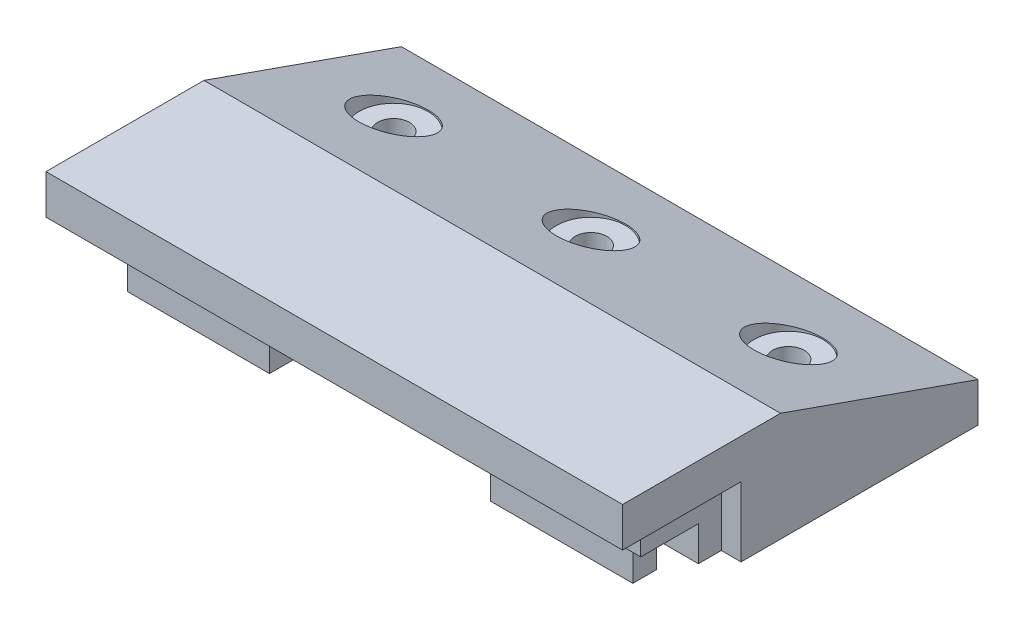
ISO-10303-21;
HEADER;
FILE_DESCRIPTION(('STEP AP214'),'2;1');
FILE_NAME('part.step','',(''),(''),'','','');
FILE_SCHEMA(('AUTOMOTIVE_DESIGN { 1 0 10303 214 1 1 1 1 }'));
ENDSEC;
DATA;
#1=APPLICATION_CONTEXT('core data for automotive mechanical design processes');
#2=APPLICATION_PROTOCOL_DEFINITION('international standard','automotive_design',2000,#1);
#3=PRODUCT_CONTEXT('',#1,'mechanical');
#4=PRODUCT('Part','Part','',(#3));
#5=PRODUCT_RELATED_PRODUCT_CATEGORY('part','',(#4));
#6=PRODUCT_DEFINITION_FORMATION('','',#4);
#7=PRODUCT_DEFINITION_CONTEXT('part definition',#1,'design');
#8=PRODUCT_DEFINITION('design','',#6,#7);
#9=PRODUCT_DEFINITION_SHAPE('','',#8);
#10=(LENGTH_UNIT() NAMED_UNIT(*) SI_UNIT(.MILLI.,.METRE.));
#11=(NAMED_UNIT(*) PLANE_ANGLE_UNIT() SI_UNIT($,.RADIAN.));
#12=(NAMED_UNIT(*) SI_UNIT($,.STERADIAN.) SOLID_ANGLE_UNIT());
#13=UNCERTAINTY_MEASURE_WITH_UNIT(LENGTH_MEASURE(1.E-05),#10,'distance_accuracy_value','');
#14=(GEOMETRIC_REPRESENTATION_CONTEXT(3) GLOBAL_UNCERTAINTY_ASSIGNED_CONTEXT((#13)) GLOBAL_UNIT_ASSIGNED_CONTEXT((#10,
#11,#12)) REPRESENTATION_CONTEXT('',''));
#15=CARTESIAN_POINT('',(0.,0.,0.));
#16=DIRECTION('',(0.,0.,1.));
#17=DIRECTION('',(1.,0.,0.));
#18=AXIS2_PLACEMENT_3D('',#15,#16,#17);
#19=CARTESIAN_POINT('',(46.355,-5.588,-19.05));
#20=DIRECTION('',(0.,1.,0.));
#21=DIRECTION('',(0.,0.,1.));
#22=AXIS2_PLACEMENT_3D('',#19,#20,#21);
#23=PLANE('',#22);
#24=DIRECTION('',(0.,0.,1.));
#25=VECTOR('',#24,1.);
#26=CARTESIAN_POINT('',(-17.78,-5.588,-11.176));
#27=LINE('',#26,#25);
#28=CARTESIAN_POINT('',(-17.78,-5.588,-11.176));
#29=VERTEX_POINT('',#28);
#30=CARTESIAN_POINT('',(-17.78,-5.588,-7.36600000000001));
#31=VERTEX_POINT('',#30);
#32=EDGE_CURVE('E249',#29,#31,#27,.T.);
#33=ORIENTED_EDGE('',*,*,#32,.F.);
#34=DIRECTION('',(1.,0.,0.));
#35=VECTOR('',#34,1.);
#36=CARTESIAN_POINT('',(-40.64,-5.588,-11.176));
#37=LINE('',#36,#35);
#38=CARTESIAN_POINT('',(-40.64,-5.588,-11.176));
#39=VERTEX_POINT('',#38);
#40=EDGE_CURVE('E245',#39,#29,#37,.T.);
#41=ORIENTED_EDGE('',*,*,#40,.F.);
#42=DIRECTION('',(0.,0.,-1.));
#43=VECTOR('',#42,1.);
#44=CARTESIAN_POINT('',(-40.64,-5.588,-7.36600000000001));
#45=LINE('',#44,#43);
#46=CARTESIAN_POINT('',(-40.64,-5.588,-7.36600000000001));
#47=VERTEX_POINT('',#46);
#48=EDGE_CURVE('E240',#47,#39,#45,.T.);
#49=ORIENTED_EDGE('',*,*,#48,.F.);
#50=DIRECTION('',(-1.,0.,0.));
#51=VECTOR('',#50,1.);
#52=CARTESIAN_POINT('',(-17.78,-5.588,-7.36600000000001));
#53=LINE('',#52,#51);
#54=EDGE_CURVE('E236',#31,#47,#53,.T.);
#55=ORIENTED_EDGE('',*,*,#54,.F.);
#56=EDGE_LOOP('',(#33,#41,#49,#55));
#57=FACE_BOUND('',#56,.T.);
#58=DIRECTION('',(0.,0.,1.));
#59=VECTOR('',#58,1.);
#60=CARTESIAN_POINT('',(43.18,-5.588,0.));
#61=LINE('',#60,#59);
#62=CARTESIAN_POINT('',(43.18,-5.588,-15.367));
#63=VERTEX_POINT('',#62);
#64=CARTESIAN_POINT('',(43.18,-5.588,-6.09600000000001));
#65=VERTEX_POINT('',#64);
#66=EDGE_CURVE('E279',#63,#65,#61,.T.);
#67=ORIENTED_EDGE('',*,*,#66,.T.);
#68=DIRECTION('',(-1.,0.,0.));
#69=VECTOR('',#68,1.);
#70=CARTESIAN_POINT('',(0.,-5.588,-6.09600000000001));
#71=LINE('',#70,#69);
#72=CARTESIAN_POINT('',(-43.18,-5.588,-6.09600000000001));
#73=VERTEX_POINT('',#72);
#74=EDGE_CURVE('E275',#65,#73,#71,.T.);
#75=ORIENTED_EDGE('',*,*,#74,.T.);
#76=DIRECTION('',(0.,0.,-1.));
#77=VECTOR('',#76,1.);
#78=CARTESIAN_POINT('',(-43.18,-5.588,0.));
#79=LINE('',#78,#77);
#80=CARTESIAN_POINT('',(-43.18,-5.588,-15.367));
#81=VERTEX_POINT('',#80);
#82=EDGE_CURVE('E272',#73,#81,#79,.T.);
#83=ORIENTED_EDGE('',*,*,#82,.T.);
#84=DIRECTION('',(-1.,0.,0.));
#85=VECTOR('',#84,1.);
#86=CARTESIAN_POINT('',(0.,-5.588,-15.367));
#87=LINE('',#86,#85);
#88=EDGE_CURVE('E276',#63,#81,#87,.T.);
#89=ORIENTED_EDGE('',*,*,#88,.F.);
#90=EDGE_LOOP('',(#67,#75,#83,#89));
#91=FACE_BOUND('',#90,.T.);
#92=DIRECTION('',(0.,0.,-1.));
#93=VECTOR('',#92,1.);
#94=CARTESIAN_POINT('',(17.78,-5.588,-11.176));
#95=LINE('',#94,#93);
#96=CARTESIAN_POINT('',(17.78,-5.588,-7.36600000000001));
#97=VERTEX_POINT('',#96);
#98=CARTESIAN_POINT('',(17.78,-5.588,-11.176));
#99=VERTEX_POINT('',#98);
#100=EDGE_CURVE('E65',#97,#99,#95,.T.);
#101=ORIENTED_EDGE('',*,*,#100,.F.);
#102=DIRECTION('',(-1.,0.,0.));
#103=VECTOR('',#102,1.);
#104=CARTESIAN_POINT('',(17.78,-5.588,-7.36600000000001));
#105=LINE('',#104,#103);
#106=CARTESIAN_POINT('',(40.64,-5.588,-7.36600000000001));
#107=VERTEX_POINT('',#106);
#108=EDGE_CURVE('E70',#107,#97,#105,.T.);
#109=ORIENTED_EDGE('',*,*,#108,.F.);
#110=DIRECTION('',(0.,0.,1.));
#111=VECTOR('',#110,1.);
#112=CARTESIAN_POINT('',(40.64,-5.588,-7.36600000000001));
#113=LINE('',#112,#111);
#114=CARTESIAN_POINT('',(40.64,-5.588,-11.176));
#115=VERTEX_POINT('',#114);
#116=EDGE_CURVE('E207',#115,#107,#113,.T.);
#117=ORIENTED_EDGE('',*,*,#116,.F.);
#118=DIRECTION('',(1.,0.,0.));
#119=VECTOR('',#118,1.);
#120=CARTESIAN_POINT('',(40.64,-5.588,-11.176));
#121=LINE('',#120,#119);
#122=EDGE_CURVE('E241',#99,#115,#121,.T.);
#123=ORIENTED_EDGE('',*,*,#122,.F.);
#124=EDGE_LOOP('',(#101,#109,#117,#123));
#125=FACE_BOUND('',#124,.T.);
#126=ADVANCED_FACE('F47',(#57,#91,#125),#23,.F.);
#127=CARTESIAN_POINT('',(0.,-97.6144988821532,-15.367));
#128=DIRECTION('',(0.,0.,1.));
#129=DIRECTION('',(1.,0.,0.));
#130=AXIS2_PLACEMENT_3D('',#127,#128,#129);
#131=PLANE('',#130);
#132=DIRECTION('',(0.,1.,0.));
#133=VECTOR('',#132,1.);
#134=CARTESIAN_POINT('',(43.18,-97.6144988821532,-15.367));
#135=LINE('',#134,#133);
#136=CARTESIAN_POINT('',(43.18,-11.176,-15.367));
#137=VERTEX_POINT('',#136);
#138=EDGE_CURVE('E318',#137,#63,#135,.T.);
#139=ORIENTED_EDGE('',*,*,#138,.T.);
#140=ORIENTED_EDGE('',*,*,#88,.T.);
#141=DIRECTION('',(0.,1.,0.));
#142=VECTOR('',#141,1.);
#143=CARTESIAN_POINT('',(-43.18,-97.6144988821532,-15.367));
#144=LINE('',#143,#142);
#145=CARTESIAN_POINT('',(-43.18,-11.176,-15.367));
#146=VERTEX_POINT('',#145);
#147=EDGE_CURVE('E314',#146,#81,#144,.T.);
#148=ORIENTED_EDGE('',*,*,#147,.F.);
#149=DIRECTION('',(-1.,0.,0.));
#150=VECTOR('',#149,1.);
#151=CARTESIAN_POINT('',(0.,-11.176,-15.367));
#152=LINE('',#151,#150);
#153=EDGE_CURVE('E297',#137,#146,#152,.T.);
#154=ORIENTED_EDGE('',*,*,#153,.F.);
#155=EDGE_LOOP('',(#139,#140,#148,#154));
#156=FACE_BOUND('',#155,.T.);
#157=ADVANCED_FACE('F466',(#156),#131,.T.);
#158=CARTESIAN_POINT('',(46.355,0.,0.));
#159=DIRECTION('',(0.,1.,0.));
#160=DIRECTION('',(0.,0.,1.));
#161=AXIS2_PLACEMENT_3D('',#158,#159,#160);
#162=PLANE('',#161);
#163=DIRECTION('',(0.,0.,1.));
#164=VECTOR('',#163,1.);
#165=CARTESIAN_POINT('',(-43.18,0.,0.));
#166=LINE('',#165,#164);
#167=CARTESIAN_POINT('',(-43.18,0.,-19.05));
#168=VERTEX_POINT('',#167);
#169=CARTESIAN_POINT('',(-43.18,0.,-6.09600000000001));
#170=VERTEX_POINT('',#169);
#171=EDGE_CURVE('E307',#168,#170,#166,.T.);
#172=ORIENTED_EDGE('',*,*,#171,.T.);
#173=DIRECTION('',(1.,0.,0.));
#174=VECTOR('',#173,1.);
#175=CARTESIAN_POINT('',(0.,0.,-6.09600000000001));
#176=LINE('',#175,#174);
#177=CARTESIAN_POINT('',(43.18,0.,-6.09600000000001));
#178=VERTEX_POINT('',#177);
#179=EDGE_CURVE('E235',#170,#178,#176,.T.);
#180=ORIENTED_EDGE('',*,*,#179,.T.);
#181=DIRECTION('',(0.,0.,1.));
#182=VECTOR('',#181,1.);
#183=CARTESIAN_POINT('',(43.18,0.,0.));
#184=LINE('',#183,#182);
#185=CARTESIAN_POINT('',(43.18,0.,-19.05));
#186=VERTEX_POINT('',#185);
#187=EDGE_CURVE('E282',#186,#178,#184,.T.);
#188=ORIENTED_EDGE('',*,*,#187,.F.);
#189=DIRECTION('',(-1.,0.,0.));
#190=VECTOR('',#189,1.);
#191=CARTESIAN_POINT('',(46.355,0.,-19.05));
#192=LINE('',#191,#190);
#193=CARTESIAN_POINT('',(46.355,0.,-19.05));
#194=VERTEX_POINT('',#193);
#195=EDGE_CURVE('E57',#194,#186,#192,.T.);
#196=ORIENTED_EDGE('',*,*,#195,.F.);
#197=DIRECTION('',(0.,0.,-1.));
#198=VECTOR('',#197,1.);
#199=CARTESIAN_POINT('',(46.355,0.,0.));
#200=LINE('',#199,#198);
#201=CARTESIAN_POINT('',(46.355,0.,0.));
#202=VERTEX_POINT('',#201);
#203=EDGE_CURVE('E332',#202,#194,#200,.T.);
#204=ORIENTED_EDGE('',*,*,#203,.F.);
#205=DIRECTION('',(-1.,0.,0.));
#206=VECTOR('',#205,1.);
#207=CARTESIAN_POINT('',(46.355,0.,0.));
#208=LINE('',#207,#206);
#209=CARTESIAN_POINT('',(-46.355,0.,0.));
#210=VERTEX_POINT('',#209);
#211=EDGE_CURVE('E12',#202,#210,#208,.T.);
#212=ORIENTED_EDGE('',*,*,#211,.T.);
#213=DIRECTION('',(0.,0.,-1.));
#214=VECTOR('',#213,1.);
#215=CARTESIAN_POINT('',(-46.355,0.,0.));
#216=LINE('',#215,#214);
#217=CARTESIAN_POINT('',(-46.355,0.,-19.05));
#218=VERTEX_POINT('',#217);
#219=EDGE_CURVE('E355',#210,#218,#216,.T.);
#220=ORIENTED_EDGE('',*,*,#219,.T.);
#221=EDGE_CURVE('E394',#168,#218,#192,.T.);
#222=ORIENTED_EDGE('',*,*,#221,.F.);
#223=EDGE_LOOP('',(#172,#180,#188,#196,#204,#212,#220,#222));
#224=FACE_BOUND('',#223,.T.);
#225=ADVANCED_FACE('F474',(#224),#162,.F.);
#226=CARTESIAN_POINT('',(46.355,0.,-19.05));
#227=DIRECTION('',(0.,0.,-1.));
#228=DIRECTION('',(-1.,0.,0.));
#229=AXIS2_PLACEMENT_3D('',#226,#227,#228);
#230=PLANE('',#229);
#231=DIRECTION('',(0.,1.,0.));
#232=VECTOR('',#231,1.);
#233=CARTESIAN_POINT('',(43.18,-97.6144988821532,-19.05));
#234=LINE('',#233,#232);
#235=CARTESIAN_POINT('',(43.18,-11.176,-19.05));
#236=VERTEX_POINT('',#235);
#237=EDGE_CURVE('E301',#236,#186,#234,.T.);
#238=ORIENTED_EDGE('',*,*,#237,.F.);
#239=DIRECTION('',(-1.,0.,0.));
#240=VECTOR('',#239,1.);
#241=CARTESIAN_POINT('',(46.355,-11.176,-19.05));
#242=LINE('',#241,#240);
#243=CARTESIAN_POINT('',(46.355,-11.176,-19.05));
#244=VERTEX_POINT('',#243);
#245=EDGE_CURVE('E390',#244,#236,#242,.T.);
#246=ORIENTED_EDGE('',*,*,#245,.F.);
#247=DIRECTION('',(0.,-1.,0.));
#248=VECTOR('',#247,1.);
#249=CARTESIAN_POINT('',(46.355,0.,-19.05));
#250=LINE('',#249,#248);
#251=EDGE_CURVE('E336',#194,#244,#250,.T.);
#252=ORIENTED_EDGE('',*,*,#251,.F.);
#253=ORIENTED_EDGE('',*,*,#195,.T.);
#254=EDGE_LOOP('',(#238,#246,#252,#253));
#255=FACE_BOUND('',#254,.T.);
#256=ADVANCED_FACE('F520',(#255),#230,.F.);
#257=CARTESIAN_POINT('',(46.355,0.,0.));
#258=DIRECTION('',(0.,0.,-1.));
#259=DIRECTION('',(-1.,0.,0.));
#260=AXIS2_PLACEMENT_3D('',#257,#258,#259);
#261=PLANE('',#260);
#262=DIRECTION('',(0.,-1.,0.));
#263=VECTOR('',#262,1.);
#264=CARTESIAN_POINT('',(-46.355,0.,0.));
#265=LINE('',#264,#263);
#266=CARTESIAN_POINT('',(-46.355,6.35,0.));
#267=VERTEX_POINT('',#266);
#268=EDGE_CURVE('E327',#267,#210,#265,.T.);
#269=ORIENTED_EDGE('',*,*,#268,.T.);
#270=ORIENTED_EDGE('',*,*,#211,.F.);
#271=DIRECTION('',(0.,-1.,0.));
#272=VECTOR('',#271,1.);
#273=CARTESIAN_POINT('',(46.355,0.,0.));
#274=LINE('',#273,#272);
#275=CARTESIAN_POINT('',(46.355,6.35,0.));
#276=VERTEX_POINT('',#275);
#277=EDGE_CURVE('E328',#276,#202,#274,.T.);
#278=ORIENTED_EDGE('',*,*,#277,.F.);
#279=DIRECTION('',(-1.,0.,0.));
#280=VECTOR('',#279,1.);
#281=CARTESIAN_POINT('',(46.355,6.35,0.));
#282=LINE('',#281,#280);
#283=EDGE_CURVE('E351',#276,#267,#282,.T.);
#284=ORIENTED_EDGE('',*,*,#283,.T.);
#285=EDGE_LOOP('',(#269,#270,#278,#284));
#286=FACE_BOUND('',#285,.T.);
#287=ADVANCED_FACE('F49',(#286),#261,.F.);
#288=CARTESIAN_POINT('',(-43.18,-11.176,-19.05));
#289=VERTEX_POINT('',#288);
#290=CARTESIAN_POINT('',(-46.355,-11.176,-19.05));
#291=VERTEX_POINT('',#290);
#292=EDGE_CURVE('E389',#289,#291,#242,.T.);
#293=ORIENTED_EDGE('',*,*,#292,.F.);
#294=DIRECTION('',(0.,1.,0.));
#295=VECTOR('',#294,1.);
#296=CARTESIAN_POINT('',(-43.18,-97.6144988821532,-19.05));
#297=LINE('',#296,#295);
#298=EDGE_CURVE('E310',#289,#168,#297,.T.);
#299=ORIENTED_EDGE('',*,*,#298,.T.);
#300=ORIENTED_EDGE('',*,*,#221,.T.);
#301=DIRECTION('',(0.,-1.,0.));
#302=VECTOR('',#301,1.);
#303=CARTESIAN_POINT('',(-46.355,0.,-19.05));
#304=LINE('',#303,#302);
#305=EDGE_CURVE('E359',#218,#291,#304,.T.);
#306=ORIENTED_EDGE('',*,*,#305,.T.);
#307=EDGE_LOOP('',(#293,#299,#300,#306));
#308=FACE_BOUND('',#307,.T.);
#309=ADVANCED_FACE('F516',(#308),#230,.F.);
#310=CARTESIAN_POINT('',(46.355,-11.176,-19.05));
#311=DIRECTION('',(0.,1.,0.));
#312=DIRECTION('',(0.,0.,1.));
#313=AXIS2_PLACEMENT_3D('',#310,#311,#312);
#314=PLANE('',#313);
#315=CARTESIAN_POINT('',(31.75,-11.176,-41.275));
#316=DIRECTION('',(0.,1.,0.));
#317=DIRECTION('',(0.,0.,1.));
#318=AXIS2_PLACEMENT_3D('',#315,#316,#317);
#319=CIRCLE('',#318,2.5527);
#320=CARTESIAN_POINT('',(31.75,-11.176,-38.7223));
#321=VERTEX_POINT('',#320);
#322=EDGE_CURVE('E830',#321,#321,#319,.T.);
#323=ORIENTED_EDGE('',*,*,#322,.T.);
#324=EDGE_LOOP('',(#323));
#325=FACE_BOUND('',#324,.T.);
#326=CARTESIAN_POINT('',(-31.75,-11.176,-41.275));
#327=DIRECTION('',(0.,1.,0.));
#328=DIRECTION('',(0.,0.,1.));
#329=AXIS2_PLACEMENT_3D('',#326,#327,#328);
#330=CIRCLE('',#329,2.55269999999999);
#331=CARTESIAN_POINT('',(-31.75,-11.176,-38.7223));
#332=VERTEX_POINT('',#331);
#333=EDGE_CURVE('E406',#332,#332,#330,.T.);
#334=ORIENTED_EDGE('',*,*,#333,.T.);
#335=EDGE_LOOP('',(#334));
#336=FACE_BOUND('',#335,.T.);
#337=CARTESIAN_POINT('',(0.,-11.176,-41.275));
#338=DIRECTION('',(0.,1.,0.));
#339=DIRECTION('',(0.,0.,1.));
#340=AXIS2_PLACEMENT_3D('',#337,#338,#339);
#341=CIRCLE('',#340,2.5527);
#342=CARTESIAN_POINT('',(0.,-11.176,-38.7223));
#343=VERTEX_POINT('',#342);
#344=EDGE_CURVE('E401',#343,#343,#341,.T.);
#345=ORIENTED_EDGE('',*,*,#344,.T.);
#346=EDGE_LOOP('',(#345));
#347=FACE_BOUND('',#346,.T.);
#348=DIRECTION('',(0.,0.,-1.));
#349=VECTOR('',#348,1.);
#350=CARTESIAN_POINT('',(-46.355,-11.176,-19.05));
#351=LINE('',#350,#349);
#352=CARTESIAN_POINT('',(-46.355,-11.176,-57.15));
#353=VERTEX_POINT('',#352);
#354=EDGE_CURVE('E363',#291,#353,#351,.T.);
#355=ORIENTED_EDGE('',*,*,#354,.T.);
#356=DIRECTION('',(-1.,0.,0.));
#357=VECTOR('',#356,1.);
#358=CARTESIAN_POINT('',(46.355,-11.176,-57.15));
#359=LINE('',#358,#357);
#360=CARTESIAN_POINT('',(46.355,-11.176,-57.15));
#361=VERTEX_POINT('',#360);
#362=EDGE_CURVE('E385',#361,#353,#359,.T.);
#363=ORIENTED_EDGE('',*,*,#362,.F.);
#364=DIRECTION('',(0.,0.,-1.));
#365=VECTOR('',#364,1.);
#366=CARTESIAN_POINT('',(46.355,-11.176,-19.05));
#367=LINE('',#366,#365);
#368=EDGE_CURVE('E339',#244,#361,#367,.T.);
#369=ORIENTED_EDGE('',*,*,#368,.F.);
#370=ORIENTED_EDGE('',*,*,#245,.T.);
#371=DIRECTION('',(0.,0.,-1.));
#372=VECTOR('',#371,1.);
#373=CARTESIAN_POINT('',(43.18,-11.176,0.));
#374=LINE('',#373,#372);
#375=EDGE_CURVE('E300',#137,#236,#374,.T.);
#376=ORIENTED_EDGE('',*,*,#375,.F.);
#377=ORIENTED_EDGE('',*,*,#153,.T.);
#378=DIRECTION('',(0.,0.,-1.));
#379=VECTOR('',#378,1.);
#380=CARTESIAN_POINT('',(-43.18,-11.176,0.));
#381=LINE('',#380,#379);
#382=EDGE_CURVE('E304',#146,#289,#381,.T.);
#383=ORIENTED_EDGE('',*,*,#382,.T.);
#384=ORIENTED_EDGE('',*,*,#292,.T.);
#385=EDGE_LOOP('',(#355,#363,#369,#370,#376,#377,#383,#384));
#386=FACE_BOUND('',#385,.T.);
#387=ADVANCED_FACE('F512',(#325,#336,#347,#386),#314,.F.);
#388=CARTESIAN_POINT('',(46.355,-11.176,-57.15));
#389=DIRECTION('',(0.,0.,1.));
#390=DIRECTION('',(1.,0.,0.));
#391=AXIS2_PLACEMENT_3D('',#388,#389,#390);
#392=PLANE('',#391);
#393=DIRECTION('',(0.,1.,0.));
#394=VECTOR('',#393,1.);
#395=CARTESIAN_POINT('',(-46.355,-11.176,-57.15));
#396=LINE('',#395,#394);
#397=CARTESIAN_POINT('',(-46.355,-4.826,-57.15));
#398=VERTEX_POINT('',#397);
#399=EDGE_CURVE('E366',#353,#398,#396,.T.);
#400=ORIENTED_EDGE('',*,*,#399,.T.);
#401=DIRECTION('',(-1.,0.,0.));
#402=VECTOR('',#401,1.);
#403=CARTESIAN_POINT('',(46.355,-4.826,-57.15));
#404=LINE('',#403,#402);
#405=CARTESIAN_POINT('',(46.355,-4.826,-57.15));
#406=VERTEX_POINT('',#405);
#407=EDGE_CURVE('E381',#406,#398,#404,.T.);
#408=ORIENTED_EDGE('',*,*,#407,.F.);
#409=DIRECTION('',(0.,1.,0.));
#410=VECTOR('',#409,1.);
#411=CARTESIAN_POINT('',(46.355,-11.176,-57.15));
#412=LINE('',#411,#410);
#413=EDGE_CURVE('E342',#361,#406,#412,.T.);
#414=ORIENTED_EDGE('',*,*,#413,.F.);
#415=ORIENTED_EDGE('',*,*,#362,.T.);
#416=EDGE_LOOP('',(#400,#408,#414,#415));
#417=FACE_BOUND('',#416,.T.);
#418=ADVANCED_FACE('F508',(#417),#392,.F.);
#419=CARTESIAN_POINT('',(46.355,-4.826,-57.15));
#420=DIRECTION('',(0.,-0.943268630175215,0.332030557821676));
#421=DIRECTION('',(0.,-0.332030557821676,-0.943268630175215));
#422=AXIS2_PLACEMENT_3D('',#419,#420,#421);
#423=PLANE('',#422);
#424=CARTESIAN_POINT('',(31.75,0.761999999999995,-41.275));
#425=DIRECTION('',(0.,-0.943268630175215,0.332030557821676));
#426=DIRECTION('',(0.,0.332030557821676,0.943268630175215));
#427=AXIS2_PLACEMENT_3D('',#424,#425,#426);
#428=ELLIPSE('',#427,5.89042169139867,5.55625);
#429=CARTESIAN_POINT('',(31.75,2.7178,-35.71875));
#430=VERTEX_POINT('',#429);
#431=EDGE_CURVE('E51',#430,#430,#428,.T.);
#432=ORIENTED_EDGE('',*,*,#431,.T.);
#433=EDGE_LOOP('',(#432));
#434=FACE_BOUND('',#433,.T.);
#435=CARTESIAN_POINT('',(-31.75,0.761999999999995,-41.275));
#436=DIRECTION('',(0.,-0.943268630175215,0.332030557821676));
#437=DIRECTION('',(0.,0.332030557821676,0.943268630175215));
#438=AXIS2_PLACEMENT_3D('',#435,#436,#437);
#439=ELLIPSE('',#438,5.89042169139867,5.55625);
#440=CARTESIAN_POINT('',(-31.75,2.71779999999999,-35.71875));
#441=VERTEX_POINT('',#440);
#442=EDGE_CURVE('E402',#441,#441,#439,.T.);
#443=ORIENTED_EDGE('',*,*,#442,.T.);
#444=EDGE_LOOP('',(#443));
#445=FACE_BOUND('',#444,.T.);
#446=CARTESIAN_POINT('',(0.,0.761999999999995,-41.275));
#447=DIRECTION('',(0.,-0.943268630175215,0.332030557821676));
#448=DIRECTION('',(0.,0.332030557821676,0.943268630175215));
#449=AXIS2_PLACEMENT_3D('',#446,#447,#448);
#450=ELLIPSE('',#449,5.89042169139867,5.55625);
#451=CARTESIAN_POINT('',(0.,2.71779999999999,-35.71875));
#452=VERTEX_POINT('',#451);
#453=EDGE_CURVE('E398',#452,#452,#450,.T.);
#454=ORIENTED_EDGE('',*,*,#453,.T.);
#455=EDGE_LOOP('',(#454));
#456=FACE_BOUND('',#455,.T.);
#457=DIRECTION('',(0.,0.332030557821676,0.943268630175215));
#458=VECTOR('',#457,1.);
#459=CARTESIAN_POINT('',(-46.355,-4.826,-57.15));
#460=LINE('',#459,#458);
#461=CARTESIAN_POINT('',(-46.355,6.35,-25.4));
#462=VERTEX_POINT('',#461);
#463=EDGE_CURVE('E369',#398,#462,#460,.T.);
#464=ORIENTED_EDGE('',*,*,#463,.T.);
#465=DIRECTION('',(-1.,0.,0.));
#466=VECTOR('',#465,1.);
#467=CARTESIAN_POINT('',(46.355,6.35,-25.4));
#468=LINE('',#467,#466);
#469=CARTESIAN_POINT('',(46.355,6.35,-25.4));
#470=VERTEX_POINT('',#469);
#471=EDGE_CURVE('E377',#470,#462,#468,.T.);
#472=ORIENTED_EDGE('',*,*,#471,.F.);
#473=DIRECTION('',(0.,0.332030557821676,0.943268630175215));
#474=VECTOR('',#473,1.);
#475=CARTESIAN_POINT('',(46.355,-4.826,-57.15));
#476=LINE('',#475,#474);
#477=EDGE_CURVE('E345',#406,#470,#476,.T.);
#478=ORIENTED_EDGE('',*,*,#477,.F.);
#479=ORIENTED_EDGE('',*,*,#407,.T.);
#480=EDGE_LOOP('',(#464,#472,#478,#479));
#481=FACE_BOUND('',#480,.T.);
#482=ADVANCED_FACE('F504',(#434,#445,#456,#481),#423,.F.);
#483=CARTESIAN_POINT('',(46.355,6.35,0.));
#484=DIRECTION('',(0.,-1.,0.));
#485=DIRECTION('',(0.,0.,-1.));
#486=AXIS2_PLACEMENT_3D('',#483,#484,#485);
#487=PLANE('',#486);
#488=DIRECTION('',(0.,0.,1.));
#489=VECTOR('',#488,1.);
#490=CARTESIAN_POINT('',(-46.355,6.35,0.));
#491=LINE('',#490,#489);
#492=EDGE_CURVE('E333',#462,#267,#491,.T.);
#493=ORIENTED_EDGE('',*,*,#492,.T.);
#494=ORIENTED_EDGE('',*,*,#283,.F.);
#495=DIRECTION('',(0.,0.,1.));
#496=VECTOR('',#495,1.);
#497=CARTESIAN_POINT('',(46.355,6.35,0.));
#498=LINE('',#497,#496);
#499=EDGE_CURVE('E348',#470,#276,#498,.T.);
#500=ORIENTED_EDGE('',*,*,#499,.F.);
#501=ORIENTED_EDGE('',*,*,#471,.T.);
#502=EDGE_LOOP('',(#493,#494,#500,#501));
#503=FACE_BOUND('',#502,.T.);
#504=ADVANCED_FACE('F497',(#503),#487,.F.);
#505=CARTESIAN_POINT('',(46.355,0.,0.));
#506=DIRECTION('',(-1.,0.,0.));
#507=DIRECTION('',(0.,0.,1.));
#508=AXIS2_PLACEMENT_3D('',#505,#506,#507);
#509=PLANE('',#508);
#510=ORIENTED_EDGE('',*,*,#277,.T.);
#511=ORIENTED_EDGE('',*,*,#203,.T.);
#512=ORIENTED_EDGE('',*,*,#251,.T.);
#513=ORIENTED_EDGE('',*,*,#368,.T.);
#514=ORIENTED_EDGE('',*,*,#413,.T.);
#515=ORIENTED_EDGE('',*,*,#477,.T.);
#516=ORIENTED_EDGE('',*,*,#499,.T.);
#517=EDGE_LOOP('',(#510,#511,#512,#513,#514,#515,#516));
#518=FACE_BOUND('',#517,.T.);
#519=ADVANCED_FACE('F494',(#518),#509,.F.);
#520=CARTESIAN_POINT('',(-46.355,0.,0.));
#521=DIRECTION('',(-1.,0.,0.));
#522=DIRECTION('',(0.,0.,1.));
#523=AXIS2_PLACEMENT_3D('',#520,#521,#522);
#524=PLANE('',#523);
#525=ORIENTED_EDGE('',*,*,#268,.F.);
#526=ORIENTED_EDGE('',*,*,#492,.F.);
#527=ORIENTED_EDGE('',*,*,#463,.F.);
#528=ORIENTED_EDGE('',*,*,#399,.F.);
#529=ORIENTED_EDGE('',*,*,#354,.F.);
#530=ORIENTED_EDGE('',*,*,#305,.F.);
#531=ORIENTED_EDGE('',*,*,#219,.F.);
#532=EDGE_LOOP('',(#525,#526,#527,#528,#529,#530,#531));
#533=FACE_BOUND('',#532,.T.);
#534=ADVANCED_FACE('F492',(#533),#524,.T.);
#535=CARTESIAN_POINT('',(43.18,-97.6144988821532,0.));
#536=DIRECTION('',(-1.,0.,0.));
#537=DIRECTION('',(0.,0.,1.));
#538=AXIS2_PLACEMENT_3D('',#535,#536,#537);
#539=PLANE('',#538);
#540=ORIENTED_EDGE('',*,*,#138,.F.);
#541=ORIENTED_EDGE('',*,*,#375,.T.);
#542=ORIENTED_EDGE('',*,*,#237,.T.);
#543=ORIENTED_EDGE('',*,*,#187,.T.);
#544=DIRECTION('',(0.,1.,0.));
#545=VECTOR('',#544,1.);
#546=CARTESIAN_POINT('',(43.18,-98.0322089950972,-6.09600000000001));
#547=LINE('',#546,#545);
#548=EDGE_CURVE('E290',#65,#178,#547,.T.);
#549=ORIENTED_EDGE('',*,*,#548,.F.);
#550=ORIENTED_EDGE('',*,*,#66,.F.);
#551=EDGE_LOOP('',(#540,#541,#542,#543,#549,#550));
#552=FACE_BOUND('',#551,.T.);
#553=ADVANCED_FACE('F487',(#552),#539,.F.);
#554=CARTESIAN_POINT('',(-43.18,-97.6144988821532,0.));
#555=DIRECTION('',(-1.,0.,0.));
#556=DIRECTION('',(0.,0.,1.));
#557=AXIS2_PLACEMENT_3D('',#554,#555,#556);
#558=PLANE('',#557);
#559=ORIENTED_EDGE('',*,*,#382,.F.);
#560=ORIENTED_EDGE('',*,*,#147,.T.);
#561=ORIENTED_EDGE('',*,*,#82,.F.);
#562=DIRECTION('',(0.,1.,0.));
#563=VECTOR('',#562,1.);
#564=CARTESIAN_POINT('',(-43.18,-98.0322089950972,-6.09600000000001));
#565=LINE('',#564,#563);
#566=EDGE_CURVE('E286',#73,#170,#565,.T.);
#567=ORIENTED_EDGE('',*,*,#566,.T.);
#568=ORIENTED_EDGE('',*,*,#171,.F.);
#569=ORIENTED_EDGE('',*,*,#298,.F.);
#570=EDGE_LOOP('',(#559,#560,#561,#567,#568,#569));
#571=FACE_BOUND('',#570,.T.);
#572=ADVANCED_FACE('F484',(#571),#558,.T.);
#573=CARTESIAN_POINT('',(0.,-98.0322089950972,-6.09600000000001));
#574=DIRECTION('',(0.,0.,1.));
#575=DIRECTION('',(1.,0.,0.));
#576=AXIS2_PLACEMENT_3D('',#573,#574,#575);
#577=PLANE('',#576);
#578=ORIENTED_EDGE('',*,*,#74,.F.);
#579=ORIENTED_EDGE('',*,*,#548,.T.);
#580=ORIENTED_EDGE('',*,*,#179,.F.);
#581=ORIENTED_EDGE('',*,*,#566,.F.);
#582=EDGE_LOOP('',(#578,#579,#580,#581));
#583=FACE_BOUND('',#582,.T.);
#584=ADVANCED_FACE('F481',(#583),#577,.T.);
#585=CARTESIAN_POINT('',(-17.78,-34.3513252404362,-11.176));
#586=DIRECTION('',(-1.,0.,0.));
#587=DIRECTION('',(0.,0.,1.));
#588=AXIS2_PLACEMENT_3D('',#585,#586,#587);
#589=PLANE('',#588);
#590=DIRECTION('',(0.,1.,0.));
#591=VECTOR('',#590,1.);
#592=CARTESIAN_POINT('',(-17.78,-34.3513252404362,-7.36600000000001));
#593=LINE('',#592,#591);
#594=CARTESIAN_POINT('',(-17.78,-11.176,-7.36600000000001));
#595=VERTEX_POINT('',#594);
#596=EDGE_CURVE('E253',#595,#31,#593,.T.);
#597=ORIENTED_EDGE('',*,*,#596,.F.);
#598=DIRECTION('',(0.,0.,-1.));
#599=VECTOR('',#598,1.);
#600=CARTESIAN_POINT('',(-17.78,-11.176,-11.176));
#601=LINE('',#600,#599);
#602=CARTESIAN_POINT('',(-17.78,-11.176,-11.176));
#603=VERTEX_POINT('',#602);
#604=EDGE_CURVE('E227',#595,#603,#601,.T.);
#605=ORIENTED_EDGE('',*,*,#604,.T.);
#606=DIRECTION('',(0.,1.,0.));
#607=VECTOR('',#606,1.);
#608=CARTESIAN_POINT('',(-17.78,-34.3513252404362,-11.176));
#609=LINE('',#608,#607);
#610=EDGE_CURVE('E257',#603,#29,#609,.T.);
#611=ORIENTED_EDGE('',*,*,#610,.T.);
#612=ORIENTED_EDGE('',*,*,#32,.T.);
#613=EDGE_LOOP('',(#597,#605,#611,#612));
#614=FACE_BOUND('',#613,.T.);
#615=ADVANCED_FACE('F483',(#614),#589,.F.);
#616=CARTESIAN_POINT('',(-40.64,-34.3513252404362,-11.176));
#617=DIRECTION('',(0.,0.,1.));
#618=DIRECTION('',(1.,0.,0.));
#619=AXIS2_PLACEMENT_3D('',#616,#617,#618);
#620=PLANE('',#619);
#621=ORIENTED_EDGE('',*,*,#610,.F.);
#622=DIRECTION('',(-1.,0.,0.));
#623=VECTOR('',#622,1.);
#624=CARTESIAN_POINT('',(-40.64,-11.176,-11.176));
#625=LINE('',#624,#623);
#626=CARTESIAN_POINT('',(-40.64,-11.176,-11.176));
#627=VERTEX_POINT('',#626);
#628=EDGE_CURVE('E222',#603,#627,#625,.T.);
#629=ORIENTED_EDGE('',*,*,#628,.T.);
#630=DIRECTION('',(0.,1.,0.));
#631=VECTOR('',#630,1.);
#632=CARTESIAN_POINT('',(-40.64,-34.3513252404362,-11.176));
#633=LINE('',#632,#631);
#634=EDGE_CURVE('E261',#627,#39,#633,.T.);
#635=ORIENTED_EDGE('',*,*,#634,.T.);
#636=ORIENTED_EDGE('',*,*,#40,.T.);
#637=EDGE_LOOP('',(#621,#629,#635,#636));
#638=FACE_BOUND('',#637,.T.);
#639=ADVANCED_FACE('F629',(#638),#620,.F.);
#640=CARTESIAN_POINT('',(-40.64,-34.3513252404362,-7.36600000000001));
#641=DIRECTION('',(1.,0.,0.));
#642=DIRECTION('',(0.,0.,-1.));
#643=AXIS2_PLACEMENT_3D('',#640,#641,#642);
#644=PLANE('',#643);
#645=ORIENTED_EDGE('',*,*,#634,.F.);
#646=DIRECTION('',(0.,0.,1.));
#647=VECTOR('',#646,1.);
#648=CARTESIAN_POINT('',(-40.64,-11.176,-7.36600000000001));
#649=LINE('',#648,#647);
#650=CARTESIAN_POINT('',(-40.64,-11.176,-7.36600000000001));
#651=VERTEX_POINT('',#650);
#652=EDGE_CURVE('E226',#627,#651,#649,.T.);
#653=ORIENTED_EDGE('',*,*,#652,.T.);
#654=DIRECTION('',(0.,1.,0.));
#655=VECTOR('',#654,1.);
#656=CARTESIAN_POINT('',(-40.64,-34.3513252404362,-7.36600000000001));
#657=LINE('',#656,#655);
#658=EDGE_CURVE('E265',#651,#47,#657,.T.);
#659=ORIENTED_EDGE('',*,*,#658,.T.);
#660=ORIENTED_EDGE('',*,*,#48,.T.);
#661=EDGE_LOOP('',(#645,#653,#659,#660));
#662=FACE_BOUND('',#661,.T.);
#663=ADVANCED_FACE('F638',(#662),#644,.F.);
#664=CARTESIAN_POINT('',(-17.78,-34.3513252404362,-7.36600000000001));
#665=DIRECTION('',(0.,0.,-1.));
#666=DIRECTION('',(-1.,0.,0.));
#667=AXIS2_PLACEMENT_3D('',#664,#665,#666);
#668=PLANE('',#667);
#669=ORIENTED_EDGE('',*,*,#658,.F.);
#670=DIRECTION('',(1.,0.,0.));
#671=VECTOR('',#670,1.);
#672=CARTESIAN_POINT('',(-17.78,-11.176,-7.36600000000001));
#673=LINE('',#672,#671);
#674=EDGE_CURVE('E231',#651,#595,#673,.T.);
#675=ORIENTED_EDGE('',*,*,#674,.T.);
#676=ORIENTED_EDGE('',*,*,#596,.T.);
#677=ORIENTED_EDGE('',*,*,#54,.T.);
#678=EDGE_LOOP('',(#669,#675,#676,#677));
#679=FACE_BOUND('',#678,.T.);
#680=ADVANCED_FACE('F461',(#679),#668,.F.);
#681=CARTESIAN_POINT('',(46.355,-11.176,-19.05));
#682=DIRECTION('',(0.,1.,0.));
#683=DIRECTION('',(0.,0.,1.));
#684=AXIS2_PLACEMENT_3D('',#681,#682,#683);
#685=PLANE('',#684);
#686=ORIENTED_EDGE('',*,*,#652,.F.);
#687=ORIENTED_EDGE('',*,*,#628,.F.);
#688=ORIENTED_EDGE('',*,*,#604,.F.);
#689=ORIENTED_EDGE('',*,*,#674,.F.);
#690=EDGE_LOOP('',(#686,#687,#688,#689));
#691=FACE_BOUND('',#690,.T.);
#692=ADVANCED_FACE('F454',(#691),#685,.F.);
#693=CARTESIAN_POINT('',(17.78,-34.3513252404362,-11.176));
#694=DIRECTION('',(1.,0.,0.));
#695=DIRECTION('',(0.,0.,-1.));
#696=AXIS2_PLACEMENT_3D('',#693,#694,#695);
#697=PLANE('',#696);
#698=DIRECTION('',(0.,1.,0.));
#699=VECTOR('',#698,1.);
#700=CARTESIAN_POINT('',(17.78,-34.3513252404362,-11.176));
#701=LINE('',#700,#699);
#702=CARTESIAN_POINT('',(17.78,-11.176,-11.176));
#703=VERTEX_POINT('',#702);
#704=EDGE_CURVE('E435',#703,#99,#701,.T.);
#705=ORIENTED_EDGE('',*,*,#704,.F.);
#706=DIRECTION('',(0.,0.,1.));
#707=VECTOR('',#706,1.);
#708=CARTESIAN_POINT('',(17.78,-11.176,-11.176));
#709=LINE('',#708,#707);
#710=CARTESIAN_POINT('',(17.78,-11.176,-7.36600000000001));
#711=VERTEX_POINT('',#710);
#712=EDGE_CURVE('E216',#703,#711,#709,.T.);
#713=ORIENTED_EDGE('',*,*,#712,.T.);
#714=DIRECTION('',(0.,1.,0.));
#715=VECTOR('',#714,1.);
#716=CARTESIAN_POINT('',(17.78,-34.3513252404362,-7.36600000000001));
#717=LINE('',#716,#715);
#718=EDGE_CURVE('E210',#711,#97,#717,.T.);
#719=ORIENTED_EDGE('',*,*,#718,.T.);
#720=ORIENTED_EDGE('',*,*,#100,.T.);
#721=EDGE_LOOP('',(#705,#713,#719,#720));
#722=FACE_BOUND('',#721,.T.);
#723=ADVANCED_FACE('F452',(#722),#697,.F.);
#724=CARTESIAN_POINT('',(17.78,-34.3513252404362,-7.36600000000001));
#725=DIRECTION('',(0.,0.,-1.));
#726=DIRECTION('',(-1.,0.,0.));
#727=AXIS2_PLACEMENT_3D('',#724,#725,#726);
#728=PLANE('',#727);
#729=ORIENTED_EDGE('',*,*,#718,.F.);
#730=DIRECTION('',(1.,0.,0.));
#731=VECTOR('',#730,1.);
#732=CARTESIAN_POINT('',(17.78,-11.176,-7.36600000000001));
#733=LINE('',#732,#731);
#734=CARTESIAN_POINT('',(40.64,-11.176,-7.36600000000001));
#735=VERTEX_POINT('',#734);
#736=EDGE_CURVE('E195',#711,#735,#733,.T.);
#737=ORIENTED_EDGE('',*,*,#736,.T.);
#738=DIRECTION('',(0.,1.,0.));
#739=VECTOR('',#738,1.);
#740=CARTESIAN_POINT('',(40.64,-34.3513252404362,-7.36600000000001));
#741=LINE('',#740,#739);
#742=EDGE_CURVE('E205',#735,#107,#741,.T.);
#743=ORIENTED_EDGE('',*,*,#742,.T.);
#744=ORIENTED_EDGE('',*,*,#108,.T.);
#745=EDGE_LOOP('',(#729,#737,#743,#744));
#746=FACE_BOUND('',#745,.T.);
#747=ADVANCED_FACE('F213',(#746),#728,.F.);
#748=CARTESIAN_POINT('',(40.64,-34.3513252404362,-7.36600000000001));
#749=DIRECTION('',(-1.,0.,0.));
#750=DIRECTION('',(0.,0.,1.));
#751=AXIS2_PLACEMENT_3D('',#748,#749,#750);
#752=PLANE('',#751);
#753=ORIENTED_EDGE('',*,*,#742,.F.);
#754=DIRECTION('',(0.,0.,-1.));
#755=VECTOR('',#754,1.);
#756=CARTESIAN_POINT('',(40.64,-11.176,-7.36600000000001));
#757=LINE('',#756,#755);
#758=CARTESIAN_POINT('',(40.64,-11.176,-11.176));
#759=VERTEX_POINT('',#758);
#760=EDGE_CURVE('E191',#735,#759,#757,.T.);
#761=ORIENTED_EDGE('',*,*,#760,.T.);
#762=DIRECTION('',(0.,1.,0.));
#763=VECTOR('',#762,1.);
#764=CARTESIAN_POINT('',(40.64,-34.3513252404362,-11.176));
#765=LINE('',#764,#763);
#766=EDGE_CURVE('E211',#759,#115,#765,.T.);
#767=ORIENTED_EDGE('',*,*,#766,.T.);
#768=ORIENTED_EDGE('',*,*,#116,.T.);
#769=EDGE_LOOP('',(#753,#761,#767,#768));
#770=FACE_BOUND('',#769,.T.);
#771=ADVANCED_FACE('F206',(#770),#752,.F.);
#772=CARTESIAN_POINT('',(40.64,-34.3513252404362,-11.176));
#773=DIRECTION('',(0.,0.,1.));
#774=DIRECTION('',(1.,0.,0.));
#775=AXIS2_PLACEMENT_3D('',#772,#773,#774);
#776=PLANE('',#775);
#777=ORIENTED_EDGE('',*,*,#766,.F.);
#778=DIRECTION('',(-1.,0.,0.));
#779=VECTOR('',#778,1.);
#780=CARTESIAN_POINT('',(40.64,-11.176,-11.176));
#781=LINE('',#780,#779);
#782=EDGE_CURVE('E198',#759,#703,#781,.T.);
#783=ORIENTED_EDGE('',*,*,#782,.T.);
#784=ORIENTED_EDGE('',*,*,#704,.T.);
#785=ORIENTED_EDGE('',*,*,#122,.T.);
#786=EDGE_LOOP('',(#777,#783,#784,#785));
#787=FACE_BOUND('',#786,.T.);
#788=ADVANCED_FACE('F450',(#787),#776,.F.);
#789=CARTESIAN_POINT('',(46.355,-11.176,-19.05));
#790=DIRECTION('',(0.,1.,0.));
#791=DIRECTION('',(0.,0.,1.));
#792=AXIS2_PLACEMENT_3D('',#789,#790,#791);
#793=PLANE('',#792);
#794=ORIENTED_EDGE('',*,*,#760,.F.);
#795=ORIENTED_EDGE('',*,*,#736,.F.);
#796=ORIENTED_EDGE('',*,*,#712,.F.);
#797=ORIENTED_EDGE('',*,*,#782,.F.);
#798=EDGE_LOOP('',(#794,#795,#796,#797));
#799=FACE_BOUND('',#798,.T.);
#800=ADVANCED_FACE('F193',(#799),#793,.F.);
#801=CARTESIAN_POINT('',(0.,6.35,-41.275));
#802=DIRECTION('',(0.,1.,0.));
#803=DIRECTION('',(0.,0.,1.));
#804=AXIS2_PLACEMENT_3D('',#801,#802,#803);
#805=CYLINDRICAL_SURFACE('',#804,5.55625);
#806=CARTESIAN_POINT('',(0.,-1.397,-41.275));
#807=DIRECTION('',(0.,1.,0.));
#808=DIRECTION('',(0.,0.,1.));
#809=AXIS2_PLACEMENT_3D('',#806,#807,#808);
#810=CIRCLE('',#809,5.55625);
#811=CARTESIAN_POINT('',(0.,-1.397,-35.71875));
#812=VERTEX_POINT('',#811);
#813=EDGE_CURVE('E405',#812,#812,#810,.T.);
#814=ORIENTED_EDGE('',*,*,#813,.F.);
#815=EDGE_LOOP('',(#814));
#816=FACE_BOUND('',#815,.T.);
#817=ORIENTED_EDGE('',*,*,#453,.F.);
#818=EDGE_LOOP('',(#817));
#819=FACE_BOUND('',#818,.T.);
#820=ADVANCED_FACE('F689',(#816,#819),#805,.F.);
#821=CARTESIAN_POINT('',(0.,6.35,-41.275));
#822=DIRECTION('',(0.,1.,0.));
#823=DIRECTION('',(0.,0.,1.));
#824=AXIS2_PLACEMENT_3D('',#821,#822,#823);
#825=CYLINDRICAL_SURFACE('',#824,2.5527);
#826=ORIENTED_EDGE('',*,*,#344,.F.);
#827=EDGE_LOOP('',(#826));
#828=FACE_BOUND('',#827,.T.);
#829=CARTESIAN_POINT('',(0.,-1.397,-41.275));
#830=DIRECTION('',(0.,1.,0.));
#831=DIRECTION('',(0.,0.,1.));
#832=AXIS2_PLACEMENT_3D('',#829,#830,#831);
#833=CIRCLE('',#832,2.5527);
#834=CARTESIAN_POINT('',(0.,-1.397,-38.7223));
#835=VERTEX_POINT('',#834);
#836=EDGE_CURVE('E412',#835,#835,#833,.T.);
#837=ORIENTED_EDGE('',*,*,#836,.T.);
#838=EDGE_LOOP('',(#837));
#839=FACE_BOUND('',#838,.T.);
#840=ADVANCED_FACE('F696',(#828,#839),#825,.F.);
#841=CARTESIAN_POINT('',(2.5527,-1.397,-41.275));
#842=DIRECTION('',(0.,-1.,0.));
#843=DIRECTION('',(0.,0.,-1.));
#844=AXIS2_PLACEMENT_3D('',#841,#842,#843);
#845=PLANE('',#844);
#846=ORIENTED_EDGE('',*,*,#836,.F.);
#847=EDGE_LOOP('',(#846));
#848=FACE_BOUND('',#847,.T.);
#849=ORIENTED_EDGE('',*,*,#813,.T.);
#850=EDGE_LOOP('',(#849));
#851=FACE_BOUND('',#850,.T.);
#852=ADVANCED_FACE('F705',(#848,#851),#845,.F.);
#853=CARTESIAN_POINT('',(-31.75,6.35,-41.275));
#854=DIRECTION('',(0.,1.,0.));
#855=DIRECTION('',(0.,0.,1.));
#856=AXIS2_PLACEMENT_3D('',#853,#854,#855);
#857=CYLINDRICAL_SURFACE('',#856,5.55625);
#858=CARTESIAN_POINT('',(-31.75,-1.397,-41.275));
#859=DIRECTION('',(0.,1.,0.));
#860=DIRECTION('',(0.,0.,1.));
#861=AXIS2_PLACEMENT_3D('',#858,#859,#860);
#862=CIRCLE('',#861,5.55625);
#863=CARTESIAN_POINT('',(-31.75,-1.397,-35.71875));
#864=VERTEX_POINT('',#863);
#865=EDGE_CURVE('E421',#864,#864,#862,.T.);
#866=ORIENTED_EDGE('',*,*,#865,.F.);
#867=EDGE_LOOP('',(#866));
#868=FACE_BOUND('',#867,.T.);
#869=ORIENTED_EDGE('',*,*,#442,.F.);
#870=EDGE_LOOP('',(#869));
#871=FACE_BOUND('',#870,.T.);
#872=ADVANCED_FACE('F714',(#868,#871),#857,.F.);
#873=CARTESIAN_POINT('',(-31.75,6.35,-41.275));
#874=DIRECTION('',(0.,1.,0.));
#875=DIRECTION('',(0.,0.,1.));
#876=AXIS2_PLACEMENT_3D('',#873,#874,#875);
#877=CYLINDRICAL_SURFACE('',#876,2.5527);
#878=ORIENTED_EDGE('',*,*,#333,.F.);
#879=EDGE_LOOP('',(#878));
#880=FACE_BOUND('',#879,.T.);
#881=CARTESIAN_POINT('',(-31.75,-1.397,-41.275));
#882=DIRECTION('',(0.,1.,0.));
#883=DIRECTION('',(0.,0.,1.));
#884=AXIS2_PLACEMENT_3D('',#881,#882,#883);
#885=CIRCLE('',#884,2.5527);
#886=CARTESIAN_POINT('',(-31.75,-1.397,-38.7223));
#887=VERTEX_POINT('',#886);
#888=EDGE_CURVE('E415',#887,#887,#885,.T.);
#889=ORIENTED_EDGE('',*,*,#888,.T.);
#890=EDGE_LOOP('',(#889));
#891=FACE_BOUND('',#890,.T.);
#892=ADVANCED_FACE('F723',(#880,#891),#877,.F.);
#893=CARTESIAN_POINT('',(-29.1973,-1.397,-41.275));
#894=DIRECTION('',(0.,-1.,0.));
#895=DIRECTION('',(0.,0.,-1.));
#896=AXIS2_PLACEMENT_3D('',#893,#894,#895);
#897=PLANE('',#896);
#898=ORIENTED_EDGE('',*,*,#888,.F.);
#899=EDGE_LOOP('',(#898));
#900=FACE_BOUND('',#899,.T.);
#901=ORIENTED_EDGE('',*,*,#865,.T.);
#902=EDGE_LOOP('',(#901));
#903=FACE_BOUND('',#902,.T.);
#904=ADVANCED_FACE('F732',(#900,#903),#897,.F.);
#905=CARTESIAN_POINT('',(31.75,6.35,-41.275));
#906=DIRECTION('',(0.,1.,0.));
#907=DIRECTION('',(0.,0.,1.));
#908=AXIS2_PLACEMENT_3D('',#905,#906,#907);
#909=CYLINDRICAL_SURFACE('',#908,5.55625);
#910=CARTESIAN_POINT('',(31.75,-1.397,-41.275));
#911=DIRECTION('',(0.,1.,0.));
#912=DIRECTION('',(0.,0.,1.));
#913=AXIS2_PLACEMENT_3D('',#910,#911,#912);
#914=CIRCLE('',#913,5.55625);
#915=CARTESIAN_POINT('',(31.75,-1.397,-35.71875));
#916=VERTEX_POINT('',#915);
#917=EDGE_CURVE('E826',#916,#916,#914,.T.);
#918=ORIENTED_EDGE('',*,*,#917,.F.);
#919=EDGE_LOOP('',(#918));
#920=FACE_BOUND('',#919,.T.);
#921=ORIENTED_EDGE('',*,*,#431,.F.);
#922=EDGE_LOOP('',(#921));
#923=FACE_BOUND('',#922,.T.);
#924=ADVANCED_FACE('F741',(#920,#923),#909,.F.);
#925=CARTESIAN_POINT('',(31.75,6.35,-41.275));
#926=DIRECTION('',(0.,1.,0.));
#927=DIRECTION('',(0.,0.,1.));
#928=AXIS2_PLACEMENT_3D('',#925,#926,#927);
#929=CYLINDRICAL_SURFACE('',#928,2.5527);
#930=ORIENTED_EDGE('',*,*,#322,.F.);
#931=EDGE_LOOP('',(#930));
#932=FACE_BOUND('',#931,.T.);
#933=CARTESIAN_POINT('',(31.75,-1.397,-41.275));
#934=DIRECTION('',(0.,1.,0.));
#935=DIRECTION('',(0.,0.,1.));
#936=AXIS2_PLACEMENT_3D('',#933,#934,#935);
#937=CIRCLE('',#936,2.5527);
#938=CARTESIAN_POINT('',(31.75,-1.397,-38.7223));
#939=VERTEX_POINT('',#938);
#940=EDGE_CURVE('E823',#939,#939,#937,.T.);
#941=ORIENTED_EDGE('',*,*,#940,.T.);
#942=EDGE_LOOP('',(#941));
#943=FACE_BOUND('',#942,.T.);
#944=ADVANCED_FACE('F750',(#932,#943),#929,.F.);
#945=CARTESIAN_POINT('',(34.3027,-1.397,-41.275));
#946=DIRECTION('',(0.,-1.,0.));
#947=DIRECTION('',(0.,0.,-1.));
#948=AXIS2_PLACEMENT_3D('',#945,#946,#947);
#949=PLANE('',#948);
#950=ORIENTED_EDGE('',*,*,#940,.F.);
#951=EDGE_LOOP('',(#950));
#952=FACE_BOUND('',#951,.T.);
#953=ORIENTED_EDGE('',*,*,#917,.T.);
#954=EDGE_LOOP('',(#953));
#955=FACE_BOUND('',#954,.T.);
#956=ADVANCED_FACE('F759',(#952,#955),#949,.F.);
#957=CLOSED_SHELL('',(#126,#157,#225,#256,#287,#309,#387,#418,#482,#504,#519,#534,#553,#572,
#584,#615,#639,#663,#680,#692,#723,#747,#771,#788,#800,#820,#840,#852,#872,#892,#904,#924,#944,#956));
#958=MANIFOLD_SOLID_BREP('B2',#957);
#959=ADVANCED_BREP_SHAPE_REPRESENTATION('',(#18,#958),#14);
#960=SHAPE_DEFINITION_REPRESENTATION(#9,#959);
ENDSEC;
END-ISO-10303-21;
